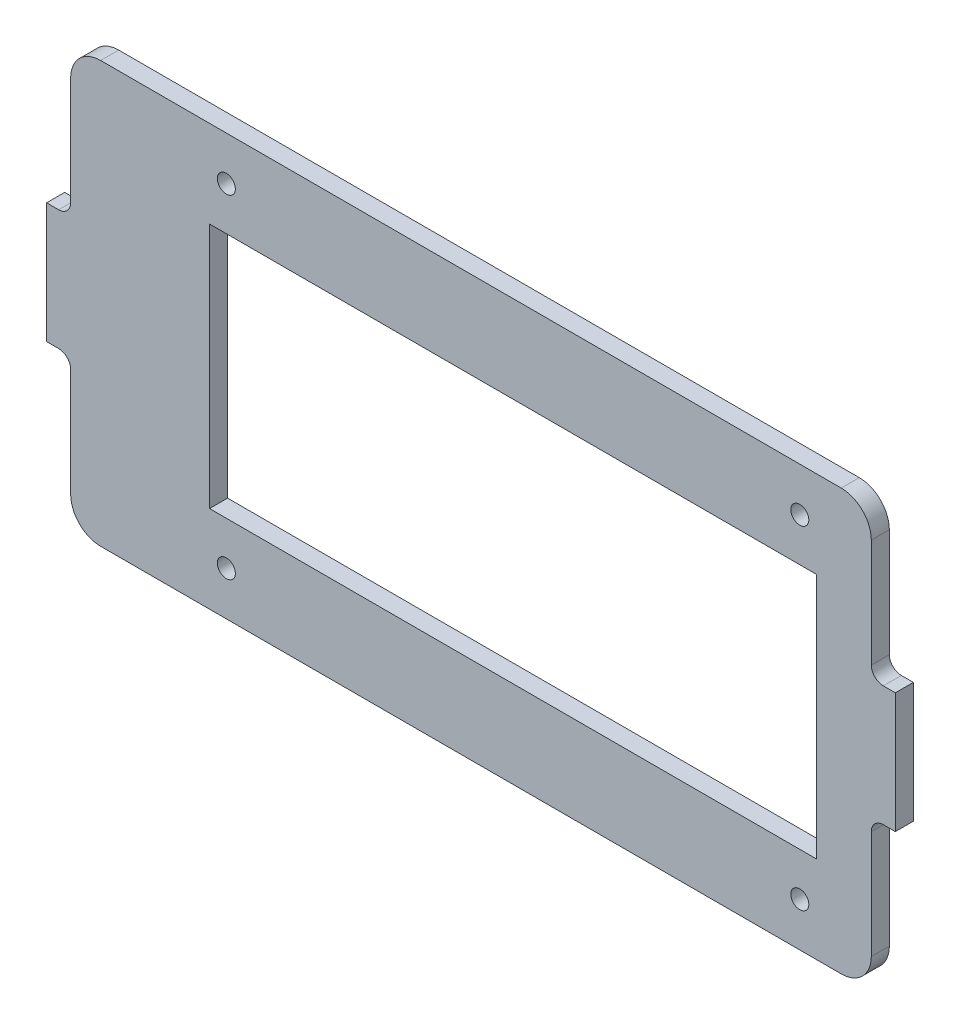
ISO-10303-21;
HEADER;
FILE_DESCRIPTION(('STEP AP214'),'2;1');
FILE_NAME('part.step','',(''),(''),'','','');
FILE_SCHEMA(('AUTOMOTIVE_DESIGN { 1 0 10303 214 1 1 1 1 }'));
ENDSEC;
DATA;
#1=APPLICATION_CONTEXT('core data for automotive mechanical design processes');
#2=APPLICATION_PROTOCOL_DEFINITION('international standard','automotive_design',2000,#1);
#3=PRODUCT_CONTEXT('',#1,'mechanical');
#4=PRODUCT('Part','Part','',(#3));
#5=PRODUCT_RELATED_PRODUCT_CATEGORY('part','',(#4));
#6=PRODUCT_DEFINITION_FORMATION('','',#4);
#7=PRODUCT_DEFINITION_CONTEXT('part definition',#1,'design');
#8=PRODUCT_DEFINITION('design','',#6,#7);
#9=PRODUCT_DEFINITION_SHAPE('','',#8);
#10=(LENGTH_UNIT() NAMED_UNIT(*) SI_UNIT(.MILLI.,.METRE.));
#11=(NAMED_UNIT(*) PLANE_ANGLE_UNIT() SI_UNIT($,.RADIAN.));
#12=(NAMED_UNIT(*) SI_UNIT($,.STERADIAN.) SOLID_ANGLE_UNIT());
#13=UNCERTAINTY_MEASURE_WITH_UNIT(LENGTH_MEASURE(1.E-05),#10,'distance_accuracy_value','');
#14=(GEOMETRIC_REPRESENTATION_CONTEXT(3) GLOBAL_UNCERTAINTY_ASSIGNED_CONTEXT((#13)) GLOBAL_UNIT_ASSIGNED_CONTEXT((#10,
#11,#12)) REPRESENTATION_CONTEXT('',''));
#15=CARTESIAN_POINT('',(0.,0.,0.));
#16=DIRECTION('',(0.,0.,1.));
#17=DIRECTION('',(1.,0.,0.));
#18=AXIS2_PLACEMENT_3D('',#15,#16,#17);
#19=CARTESIAN_POINT('',(-61.6,30.,3.));
#20=DIRECTION('',(0.,0.,1.));
#21=DIRECTION('',(1.,0.,0.));
#22=AXIS2_PLACEMENT_3D('',#19,#20,#21);
#23=PLANE('',#22);
#24=CARTESIAN_POINT('',(-40.7,27.7,3.));
#25=DIRECTION('',(0.,0.,1.));
#26=DIRECTION('',(1.,0.,0.));
#27=AXIS2_PLACEMENT_3D('',#24,#25,#26);
#28=CIRCLE('',#27,1.5);
#29=CARTESIAN_POINT('',(-39.2,27.7,3.));
#30=VERTEX_POINT('',#29);
#31=EDGE_CURVE('E726',#30,#30,#28,.T.);
#32=ORIENTED_EDGE('',*,*,#31,.F.);
#33=EDGE_LOOP('',(#32));
#34=FACE_BOUND('',#33,.T.);
#35=CARTESIAN_POINT('',(-40.6999999999997,-27.7,3.));
#36=DIRECTION('',(0.,0.,1.));
#37=DIRECTION('',(1.,0.,0.));
#38=AXIS2_PLACEMENT_3D('',#35,#36,#37);
#39=CIRCLE('',#38,1.5);
#40=CARTESIAN_POINT('',(-39.1999999999997,-27.7,3.));
#41=VERTEX_POINT('',#40);
#42=EDGE_CURVE('E728',#41,#41,#39,.T.);
#43=ORIENTED_EDGE('',*,*,#42,.F.);
#44=EDGE_LOOP('',(#43));
#45=FACE_BOUND('',#44,.T.);
#46=CARTESIAN_POINT('',(54.7,-27.7,3.));
#47=DIRECTION('',(0.,0.,1.));
#48=DIRECTION('',(1.,0.,0.));
#49=AXIS2_PLACEMENT_3D('',#46,#47,#48);
#50=CIRCLE('',#49,1.5);
#51=CARTESIAN_POINT('',(56.2,-27.7,3.));
#52=VERTEX_POINT('',#51);
#53=EDGE_CURVE('E736',#52,#52,#50,.T.);
#54=ORIENTED_EDGE('',*,*,#53,.F.);
#55=EDGE_LOOP('',(#54));
#56=FACE_BOUND('',#55,.T.);
#57=CARTESIAN_POINT('',(54.6999999999997,27.7,3.));
#58=DIRECTION('',(0.,0.,1.));
#59=DIRECTION('',(1.,0.,0.));
#60=AXIS2_PLACEMENT_3D('',#57,#58,#59);
#61=CIRCLE('',#60,1.5);
#62=CARTESIAN_POINT('',(56.1999999999997,27.7,3.));
#63=VERTEX_POINT('',#62);
#64=EDGE_CURVE('E742',#63,#63,#61,.T.);
#65=ORIENTED_EDGE('',*,*,#64,.F.);
#66=EDGE_LOOP('',(#65));
#67=FACE_BOUND('',#66,.T.);
#68=CARTESIAN_POINT('',(-61.6,30.,3.));
#69=DIRECTION('',(0.,0.,1.));
#70=DIRECTION('',(1.,0.,0.));
#71=AXIS2_PLACEMENT_3D('',#68,#69,#70);
#72=CIRCLE('',#71,5.);
#73=CARTESIAN_POINT('',(-61.6,35.,3.));
#74=VERTEX_POINT('',#73);
#75=CARTESIAN_POINT('',(-66.6,30.,3.));
#76=VERTEX_POINT('',#75);
#77=EDGE_CURVE('E232',#74,#76,#72,.T.);
#78=ORIENTED_EDGE('',*,*,#77,.T.);
#79=DIRECTION('',(0.,-1.,0.));
#80=VECTOR('',#79,1.);
#81=CARTESIAN_POINT('',(-66.6,30.,3.));
#82=LINE('',#81,#80);
#83=CARTESIAN_POINT('',(-66.6,12.,3.));
#84=VERTEX_POINT('',#83);
#85=EDGE_CURVE('E235',#76,#84,#82,.T.);
#86=ORIENTED_EDGE('',*,*,#85,.T.);
#87=CARTESIAN_POINT('',(-68.6,12.,3.));
#88=DIRECTION('',(0.,0.,-1.));
#89=DIRECTION('',(1.,0.,0.));
#90=AXIS2_PLACEMENT_3D('',#87,#88,#89);
#91=CIRCLE('',#90,1.99999999999999);
#92=CARTESIAN_POINT('',(-68.6,9.99999999999998,3.));
#93=VERTEX_POINT('',#92);
#94=EDGE_CURVE('E238',#84,#93,#91,.T.);
#95=ORIENTED_EDGE('',*,*,#94,.T.);
#96=DIRECTION('',(-1.,0.,0.));
#97=VECTOR('',#96,1.);
#98=CARTESIAN_POINT('',(-68.6,9.99999999999998,3.));
#99=LINE('',#98,#97);
#100=CARTESIAN_POINT('',(-70.6,9.99999999999998,3.));
#101=VERTEX_POINT('',#100);
#102=EDGE_CURVE('E240',#93,#101,#99,.T.);
#103=ORIENTED_EDGE('',*,*,#102,.T.);
#104=DIRECTION('',(0.,-1.,0.));
#105=VECTOR('',#104,1.);
#106=CARTESIAN_POINT('',(-70.6,9.99999999999998,3.));
#107=LINE('',#106,#105);
#108=CARTESIAN_POINT('',(-70.6,-10.,3.));
#109=VERTEX_POINT('',#108);
#110=EDGE_CURVE('E242',#101,#109,#107,.T.);
#111=ORIENTED_EDGE('',*,*,#110,.T.);
#112=DIRECTION('',(1.,0.,0.));
#113=VECTOR('',#112,1.);
#114=CARTESIAN_POINT('',(-68.6,-10.,3.));
#115=LINE('',#114,#113);
#116=CARTESIAN_POINT('',(-68.6,-10.,3.));
#117=VERTEX_POINT('',#116);
#118=EDGE_CURVE('E244',#109,#117,#115,.T.);
#119=ORIENTED_EDGE('',*,*,#118,.T.);
#120=CARTESIAN_POINT('',(-68.6,-12.,3.));
#121=DIRECTION('',(0.,0.,-1.));
#122=DIRECTION('',(-1.,0.,0.));
#123=AXIS2_PLACEMENT_3D('',#120,#121,#122);
#124=CIRCLE('',#123,1.99999999999999);
#125=CARTESIAN_POINT('',(-66.6,-12.,3.));
#126=VERTEX_POINT('',#125);
#127=EDGE_CURVE('E246',#117,#126,#124,.T.);
#128=ORIENTED_EDGE('',*,*,#127,.T.);
#129=DIRECTION('',(0.,-1.,0.));
#130=VECTOR('',#129,1.);
#131=CARTESIAN_POINT('',(-66.6,-30.,3.));
#132=LINE('',#131,#130);
#133=CARTESIAN_POINT('',(-66.6,-30.,3.));
#134=VERTEX_POINT('',#133);
#135=EDGE_CURVE('E248',#126,#134,#132,.T.);
#136=ORIENTED_EDGE('',*,*,#135,.T.);
#137=CARTESIAN_POINT('',(-61.6,-30.,3.));
#138=DIRECTION('',(0.,0.,1.));
#139=DIRECTION('',(1.,0.,0.));
#140=AXIS2_PLACEMENT_3D('',#137,#138,#139);
#141=CIRCLE('',#140,4.99999999999999);
#142=CARTESIAN_POINT('',(-61.6,-35.,3.));
#143=VERTEX_POINT('',#142);
#144=EDGE_CURVE('E250',#134,#143,#141,.T.);
#145=ORIENTED_EDGE('',*,*,#144,.T.);
#146=DIRECTION('',(1.,0.,0.));
#147=VECTOR('',#146,1.);
#148=CARTESIAN_POINT('',(-61.6,-35.,3.));
#149=LINE('',#148,#147);
#150=CARTESIAN_POINT('',(61.6,-35.,3.));
#151=VERTEX_POINT('',#150);
#152=EDGE_CURVE('E252',#143,#151,#149,.T.);
#153=ORIENTED_EDGE('',*,*,#152,.T.);
#154=CARTESIAN_POINT('',(61.6,-30.,3.));
#155=DIRECTION('',(0.,0.,1.));
#156=DIRECTION('',(1.,0.,0.));
#157=AXIS2_PLACEMENT_3D('',#154,#155,#156);
#158=CIRCLE('',#157,5.);
#159=CARTESIAN_POINT('',(66.6,-30.,3.));
#160=VERTEX_POINT('',#159);
#161=EDGE_CURVE('E254',#151,#160,#158,.T.);
#162=ORIENTED_EDGE('',*,*,#161,.T.);
#163=DIRECTION('',(0.,1.,0.));
#164=VECTOR('',#163,1.);
#165=CARTESIAN_POINT('',(66.6,-30.,3.));
#166=LINE('',#165,#164);
#167=CARTESIAN_POINT('',(66.6,-12.,3.));
#168=VERTEX_POINT('',#167);
#169=EDGE_CURVE('E256',#160,#168,#166,.T.);
#170=ORIENTED_EDGE('',*,*,#169,.T.);
#171=CARTESIAN_POINT('',(68.6,-12.,3.));
#172=DIRECTION('',(0.,0.,-1.));
#173=DIRECTION('',(1.,0.,0.));
#174=AXIS2_PLACEMENT_3D('',#171,#172,#173);
#175=CIRCLE('',#174,1.99999999999999);
#176=CARTESIAN_POINT('',(68.6,-10.,3.));
#177=VERTEX_POINT('',#176);
#178=EDGE_CURVE('E258',#168,#177,#175,.T.);
#179=ORIENTED_EDGE('',*,*,#178,.T.);
#180=DIRECTION('',(1.,0.,0.));
#181=VECTOR('',#180,1.);
#182=CARTESIAN_POINT('',(68.6,-10.,3.));
#183=LINE('',#182,#181);
#184=CARTESIAN_POINT('',(70.6,-10.,3.));
#185=VERTEX_POINT('',#184);
#186=EDGE_CURVE('E260',#177,#185,#183,.T.);
#187=ORIENTED_EDGE('',*,*,#186,.T.);
#188=DIRECTION('',(0.,1.,0.));
#189=VECTOR('',#188,1.);
#190=CARTESIAN_POINT('',(70.6,10.,3.));
#191=LINE('',#190,#189);
#192=CARTESIAN_POINT('',(70.6,10.,3.));
#193=VERTEX_POINT('',#192);
#194=EDGE_CURVE('E262',#185,#193,#191,.T.);
#195=ORIENTED_EDGE('',*,*,#194,.T.);
#196=DIRECTION('',(-1.,0.,0.));
#197=VECTOR('',#196,1.);
#198=CARTESIAN_POINT('',(68.6,10.,3.));
#199=LINE('',#198,#197);
#200=CARTESIAN_POINT('',(68.6,10.,3.));
#201=VERTEX_POINT('',#200);
#202=EDGE_CURVE('E264',#193,#201,#199,.T.);
#203=ORIENTED_EDGE('',*,*,#202,.T.);
#204=CARTESIAN_POINT('',(68.6,12.,3.));
#205=DIRECTION('',(0.,0.,-1.));
#206=DIRECTION('',(-1.,0.,0.));
#207=AXIS2_PLACEMENT_3D('',#204,#205,#206);
#208=CIRCLE('',#207,1.99999999999999);
#209=CARTESIAN_POINT('',(66.6,12.,3.));
#210=VERTEX_POINT('',#209);
#211=EDGE_CURVE('E266',#201,#210,#208,.T.);
#212=ORIENTED_EDGE('',*,*,#211,.T.);
#213=DIRECTION('',(0.,1.,0.));
#214=VECTOR('',#213,1.);
#215=CARTESIAN_POINT('',(66.6,30.,3.));
#216=LINE('',#215,#214);
#217=CARTESIAN_POINT('',(66.6,30.,3.));
#218=VERTEX_POINT('',#217);
#219=EDGE_CURVE('E268',#210,#218,#216,.T.);
#220=ORIENTED_EDGE('',*,*,#219,.T.);
#221=CARTESIAN_POINT('',(61.6,30.,3.));
#222=DIRECTION('',(0.,0.,1.));
#223=DIRECTION('',(-1.,0.,0.));
#224=AXIS2_PLACEMENT_3D('',#221,#222,#223);
#225=CIRCLE('',#224,5.);
#226=CARTESIAN_POINT('',(61.6,35.,3.));
#227=VERTEX_POINT('',#226);
#228=EDGE_CURVE('E270',#218,#227,#225,.T.);
#229=ORIENTED_EDGE('',*,*,#228,.T.);
#230=DIRECTION('',(-1.,0.,0.));
#231=VECTOR('',#230,1.);
#232=CARTESIAN_POINT('',(-61.6,35.,3.));
#233=LINE('',#232,#231);
#234=EDGE_CURVE('E272',#227,#74,#233,.T.);
#235=ORIENTED_EDGE('',*,*,#234,.T.);
#236=EDGE_LOOP('',(#78,#86,#95,#103,#111,#119,#128,#136,#145,#153,#162,#170,#179,#187,#195,#203,
#212,#220,#229,#235));
#237=FACE_BOUND('',#236,.T.);
#238=DIRECTION('',(1.,0.,0.));
#239=VECTOR('',#238,1.);
#240=CARTESIAN_POINT('',(-43.5,-20.5,3.));
#241=LINE('',#240,#239);
#242=CARTESIAN_POINT('',(-43.5,-20.5,3.));
#243=VERTEX_POINT('',#242);
#244=CARTESIAN_POINT('',(57.5,-20.5,3.));
#245=VERTEX_POINT('',#244);
#246=EDGE_CURVE('E202',#243,#245,#241,.T.);
#247=ORIENTED_EDGE('',*,*,#246,.F.);
#248=DIRECTION('',(0.,-1.,0.));
#249=VECTOR('',#248,1.);
#250=CARTESIAN_POINT('',(-43.5,20.5,3.));
#251=LINE('',#250,#249);
#252=CARTESIAN_POINT('',(-43.5,20.5,3.));
#253=VERTEX_POINT('',#252);
#254=EDGE_CURVE('E194',#253,#243,#251,.T.);
#255=ORIENTED_EDGE('',*,*,#254,.F.);
#256=DIRECTION('',(-1.,0.,0.));
#257=VECTOR('',#256,1.);
#258=CARTESIAN_POINT('',(-43.5,20.5,3.));
#259=LINE('',#258,#257);
#260=CARTESIAN_POINT('',(57.5,20.5,3.));
#261=VERTEX_POINT('',#260);
#262=EDGE_CURVE('E216',#261,#253,#259,.T.);
#263=ORIENTED_EDGE('',*,*,#262,.F.);
#264=DIRECTION('',(0.,1.,0.));
#265=VECTOR('',#264,1.);
#266=CARTESIAN_POINT('',(57.5,20.5,3.));
#267=LINE('',#266,#265);
#268=EDGE_CURVE('E214',#245,#261,#267,.T.);
#269=ORIENTED_EDGE('',*,*,#268,.F.);
#270=EDGE_LOOP('',(#247,#255,#263,#269));
#271=FACE_BOUND('',#270,.T.);
#272=ADVANCED_FACE('F33',(#34,#45,#56,#67,#237,#271),#23,.T.);
#273=CARTESIAN_POINT('',(-61.6,30.,0.));
#274=DIRECTION('',(0.,0.,1.));
#275=DIRECTION('',(1.,0.,0.));
#276=AXIS2_PLACEMENT_3D('',#273,#274,#275);
#277=PLANE('',#276);
#278=CARTESIAN_POINT('',(-40.7,27.7,0.));
#279=DIRECTION('',(0.,0.,1.));
#280=DIRECTION('',(1.,0.,0.));
#281=AXIS2_PLACEMENT_3D('',#278,#279,#280);
#282=CIRCLE('',#281,1.5);
#283=CARTESIAN_POINT('',(-39.2,27.7,0.));
#284=VERTEX_POINT('',#283);
#285=EDGE_CURVE('E724',#284,#284,#282,.T.);
#286=ORIENTED_EDGE('',*,*,#285,.T.);
#287=EDGE_LOOP('',(#286));
#288=FACE_BOUND('',#287,.T.);
#289=CARTESIAN_POINT('',(-40.6999999999997,-27.7,0.));
#290=DIRECTION('',(0.,0.,1.));
#291=DIRECTION('',(1.,0.,0.));
#292=AXIS2_PLACEMENT_3D('',#289,#290,#291);
#293=CIRCLE('',#292,1.5);
#294=CARTESIAN_POINT('',(-39.1999999999997,-27.7,0.));
#295=VERTEX_POINT('',#294);
#296=EDGE_CURVE('E733',#295,#295,#293,.T.);
#297=ORIENTED_EDGE('',*,*,#296,.T.);
#298=EDGE_LOOP('',(#297));
#299=FACE_BOUND('',#298,.T.);
#300=CARTESIAN_POINT('',(54.7,-27.7,0.));
#301=DIRECTION('',(0.,0.,1.));
#302=DIRECTION('',(1.,0.,0.));
#303=AXIS2_PLACEMENT_3D('',#300,#301,#302);
#304=CIRCLE('',#303,1.5);
#305=CARTESIAN_POINT('',(56.2,-27.7,0.));
#306=VERTEX_POINT('',#305);
#307=EDGE_CURVE('E739',#306,#306,#304,.T.);
#308=ORIENTED_EDGE('',*,*,#307,.T.);
#309=EDGE_LOOP('',(#308));
#310=FACE_BOUND('',#309,.T.);
#311=CARTESIAN_POINT('',(54.6999999999997,27.7,0.));
#312=DIRECTION('',(0.,0.,1.));
#313=DIRECTION('',(1.,0.,0.));
#314=AXIS2_PLACEMENT_3D('',#311,#312,#313);
#315=CIRCLE('',#314,1.5);
#316=CARTESIAN_POINT('',(56.1999999999997,27.7,0.));
#317=VERTEX_POINT('',#316);
#318=EDGE_CURVE('E222',#317,#317,#315,.T.);
#319=ORIENTED_EDGE('',*,*,#318,.T.);
#320=EDGE_LOOP('',(#319));
#321=FACE_BOUND('',#320,.T.);
#322=CARTESIAN_POINT('',(-61.6,30.,0.));
#323=DIRECTION('',(0.,0.,1.));
#324=DIRECTION('',(1.,0.,0.));
#325=AXIS2_PLACEMENT_3D('',#322,#323,#324);
#326=CIRCLE('',#325,5.);
#327=CARTESIAN_POINT('',(-61.6,35.,0.));
#328=VERTEX_POINT('',#327);
#329=CARTESIAN_POINT('',(-66.6,30.,0.));
#330=VERTEX_POINT('',#329);
#331=EDGE_CURVE('E210',#328,#330,#326,.T.);
#332=ORIENTED_EDGE('',*,*,#331,.F.);
#333=DIRECTION('',(-1.,0.,0.));
#334=VECTOR('',#333,1.);
#335=CARTESIAN_POINT('',(-61.6,35.,0.));
#336=LINE('',#335,#334);
#337=CARTESIAN_POINT('',(61.6,35.,0.));
#338=VERTEX_POINT('',#337);
#339=EDGE_CURVE('E236',#338,#328,#336,.T.);
#340=ORIENTED_EDGE('',*,*,#339,.F.);
#341=CARTESIAN_POINT('',(61.6,30.,0.));
#342=DIRECTION('',(0.,0.,1.));
#343=DIRECTION('',(-1.,0.,0.));
#344=AXIS2_PLACEMENT_3D('',#341,#342,#343);
#345=CIRCLE('',#344,5.);
#346=CARTESIAN_POINT('',(66.6,30.,0.));
#347=VERTEX_POINT('',#346);
#348=EDGE_CURVE('E311',#347,#338,#345,.T.);
#349=ORIENTED_EDGE('',*,*,#348,.F.);
#350=DIRECTION('',(0.,1.,0.));
#351=VECTOR('',#350,1.);
#352=CARTESIAN_POINT('',(66.6,30.,0.));
#353=LINE('',#352,#351);
#354=CARTESIAN_POINT('',(66.6,12.,0.));
#355=VERTEX_POINT('',#354);
#356=EDGE_CURVE('E309',#355,#347,#353,.T.);
#357=ORIENTED_EDGE('',*,*,#356,.F.);
#358=CARTESIAN_POINT('',(68.6,12.,0.));
#359=DIRECTION('',(0.,0.,-1.));
#360=DIRECTION('',(-1.,0.,0.));
#361=AXIS2_PLACEMENT_3D('',#358,#359,#360);
#362=CIRCLE('',#361,1.99999999999999);
#363=CARTESIAN_POINT('',(68.6,10.,0.));
#364=VERTEX_POINT('',#363);
#365=EDGE_CURVE('E307',#364,#355,#362,.T.);
#366=ORIENTED_EDGE('',*,*,#365,.F.);
#367=DIRECTION('',(-1.,0.,0.));
#368=VECTOR('',#367,1.);
#369=CARTESIAN_POINT('',(68.6,10.,0.));
#370=LINE('',#369,#368);
#371=CARTESIAN_POINT('',(70.6,10.,0.));
#372=VERTEX_POINT('',#371);
#373=EDGE_CURVE('E305',#372,#364,#370,.T.);
#374=ORIENTED_EDGE('',*,*,#373,.F.);
#375=DIRECTION('',(0.,1.,0.));
#376=VECTOR('',#375,1.);
#377=CARTESIAN_POINT('',(70.6,10.,0.));
#378=LINE('',#377,#376);
#379=CARTESIAN_POINT('',(70.6,-10.,0.));
#380=VERTEX_POINT('',#379);
#381=EDGE_CURVE('E303',#380,#372,#378,.T.);
#382=ORIENTED_EDGE('',*,*,#381,.F.);
#383=DIRECTION('',(1.,0.,0.));
#384=VECTOR('',#383,1.);
#385=CARTESIAN_POINT('',(68.6,-10.,0.));
#386=LINE('',#385,#384);
#387=CARTESIAN_POINT('',(68.6,-10.,0.));
#388=VERTEX_POINT('',#387);
#389=EDGE_CURVE('E301',#388,#380,#386,.T.);
#390=ORIENTED_EDGE('',*,*,#389,.F.);
#391=CARTESIAN_POINT('',(68.6,-12.,0.));
#392=DIRECTION('',(0.,0.,-1.));
#393=DIRECTION('',(1.,0.,0.));
#394=AXIS2_PLACEMENT_3D('',#391,#392,#393);
#395=CIRCLE('',#394,1.99999999999999);
#396=CARTESIAN_POINT('',(66.6,-12.,0.));
#397=VERTEX_POINT('',#396);
#398=EDGE_CURVE('E299',#397,#388,#395,.T.);
#399=ORIENTED_EDGE('',*,*,#398,.F.);
#400=DIRECTION('',(0.,1.,0.));
#401=VECTOR('',#400,1.);
#402=CARTESIAN_POINT('',(66.6,-30.,0.));
#403=LINE('',#402,#401);
#404=CARTESIAN_POINT('',(66.6,-30.,0.));
#405=VERTEX_POINT('',#404);
#406=EDGE_CURVE('E297',#405,#397,#403,.T.);
#407=ORIENTED_EDGE('',*,*,#406,.F.);
#408=CARTESIAN_POINT('',(61.6,-30.,0.));
#409=DIRECTION('',(0.,0.,1.));
#410=DIRECTION('',(1.,0.,0.));
#411=AXIS2_PLACEMENT_3D('',#408,#409,#410);
#412=CIRCLE('',#411,5.);
#413=CARTESIAN_POINT('',(61.6,-35.,0.));
#414=VERTEX_POINT('',#413);
#415=EDGE_CURVE('E295',#414,#405,#412,.T.);
#416=ORIENTED_EDGE('',*,*,#415,.F.);
#417=DIRECTION('',(1.,0.,0.));
#418=VECTOR('',#417,1.);
#419=CARTESIAN_POINT('',(-61.6,-35.,0.));
#420=LINE('',#419,#418);
#421=CARTESIAN_POINT('',(-61.6,-35.,0.));
#422=VERTEX_POINT('',#421);
#423=EDGE_CURVE('E293',#422,#414,#420,.T.);
#424=ORIENTED_EDGE('',*,*,#423,.F.);
#425=CARTESIAN_POINT('',(-61.6,-30.,0.));
#426=DIRECTION('',(0.,0.,1.));
#427=DIRECTION('',(1.,0.,0.));
#428=AXIS2_PLACEMENT_3D('',#425,#426,#427);
#429=CIRCLE('',#428,4.99999999999999);
#430=CARTESIAN_POINT('',(-66.6,-30.,0.));
#431=VERTEX_POINT('',#430);
#432=EDGE_CURVE('E291',#431,#422,#429,.T.);
#433=ORIENTED_EDGE('',*,*,#432,.F.);
#434=DIRECTION('',(0.,-1.,0.));
#435=VECTOR('',#434,1.);
#436=CARTESIAN_POINT('',(-66.6,-30.,0.));
#437=LINE('',#436,#435);
#438=CARTESIAN_POINT('',(-66.6,-12.,0.));
#439=VERTEX_POINT('',#438);
#440=EDGE_CURVE('E289',#439,#431,#437,.T.);
#441=ORIENTED_EDGE('',*,*,#440,.F.);
#442=CARTESIAN_POINT('',(-68.6,-12.,0.));
#443=DIRECTION('',(0.,0.,-1.));
#444=DIRECTION('',(-1.,0.,0.));
#445=AXIS2_PLACEMENT_3D('',#442,#443,#444);
#446=CIRCLE('',#445,1.99999999999999);
#447=CARTESIAN_POINT('',(-68.6,-10.,0.));
#448=VERTEX_POINT('',#447);
#449=EDGE_CURVE('E287',#448,#439,#446,.T.);
#450=ORIENTED_EDGE('',*,*,#449,.F.);
#451=DIRECTION('',(1.,0.,0.));
#452=VECTOR('',#451,1.);
#453=CARTESIAN_POINT('',(-68.6,-10.,0.));
#454=LINE('',#453,#452);
#455=CARTESIAN_POINT('',(-70.6,-10.,0.));
#456=VERTEX_POINT('',#455);
#457=EDGE_CURVE('E285',#456,#448,#454,.T.);
#458=ORIENTED_EDGE('',*,*,#457,.F.);
#459=DIRECTION('',(0.,-1.,0.));
#460=VECTOR('',#459,1.);
#461=CARTESIAN_POINT('',(-70.6,9.99999999999998,0.));
#462=LINE('',#461,#460);
#463=CARTESIAN_POINT('',(-70.6,9.99999999999998,0.));
#464=VERTEX_POINT('',#463);
#465=EDGE_CURVE('E283',#464,#456,#462,.T.);
#466=ORIENTED_EDGE('',*,*,#465,.F.);
#467=DIRECTION('',(-1.,0.,0.));
#468=VECTOR('',#467,1.);
#469=CARTESIAN_POINT('',(-68.6,9.99999999999998,0.));
#470=LINE('',#469,#468);
#471=CARTESIAN_POINT('',(-68.6,9.99999999999998,0.));
#472=VERTEX_POINT('',#471);
#473=EDGE_CURVE('E281',#472,#464,#470,.T.);
#474=ORIENTED_EDGE('',*,*,#473,.F.);
#475=CARTESIAN_POINT('',(-68.6,12.,0.));
#476=DIRECTION('',(0.,0.,-1.));
#477=DIRECTION('',(1.,0.,0.));
#478=AXIS2_PLACEMENT_3D('',#475,#476,#477);
#479=CIRCLE('',#478,1.99999999999999);
#480=CARTESIAN_POINT('',(-66.6,12.,0.));
#481=VERTEX_POINT('',#480);
#482=EDGE_CURVE('E279',#481,#472,#479,.T.);
#483=ORIENTED_EDGE('',*,*,#482,.F.);
#484=DIRECTION('',(0.,-1.,0.));
#485=VECTOR('',#484,1.);
#486=CARTESIAN_POINT('',(-66.6,30.,0.));
#487=LINE('',#486,#485);
#488=EDGE_CURVE('E277',#330,#481,#487,.T.);
#489=ORIENTED_EDGE('',*,*,#488,.F.);
#490=EDGE_LOOP('',(#332,#340,#349,#357,#366,#374,#382,#390,#399,#407,#416,#424,#433,#441,#450,
#458,#466,#474,#483,#489));
#491=FACE_BOUND('',#490,.T.);
#492=DIRECTION('',(0.,-1.,0.));
#493=VECTOR('',#492,1.);
#494=CARTESIAN_POINT('',(-43.5,20.5,0.));
#495=LINE('',#494,#493);
#496=CARTESIAN_POINT('',(-43.5,20.5,0.));
#497=VERTEX_POINT('',#496);
#498=CARTESIAN_POINT('',(-43.5,-20.5,0.));
#499=VERTEX_POINT('',#498);
#500=EDGE_CURVE('E56',#497,#499,#495,.T.);
#501=ORIENTED_EDGE('',*,*,#500,.T.);
#502=DIRECTION('',(1.,0.,0.));
#503=VECTOR('',#502,1.);
#504=CARTESIAN_POINT('',(-43.5,-20.5,0.));
#505=LINE('',#504,#503);
#506=CARTESIAN_POINT('',(57.5,-20.5,0.));
#507=VERTEX_POINT('',#506);
#508=EDGE_CURVE('E209',#499,#507,#505,.T.);
#509=ORIENTED_EDGE('',*,*,#508,.T.);
#510=DIRECTION('',(0.,1.,0.));
#511=VECTOR('',#510,1.);
#512=CARTESIAN_POINT('',(57.5,20.5,0.));
#513=LINE('',#512,#511);
#514=CARTESIAN_POINT('',(57.5,20.5,0.));
#515=VERTEX_POINT('',#514);
#516=EDGE_CURVE('E224',#507,#515,#513,.T.);
#517=ORIENTED_EDGE('',*,*,#516,.T.);
#518=DIRECTION('',(-1.,0.,0.));
#519=VECTOR('',#518,1.);
#520=CARTESIAN_POINT('',(-43.5,20.5,0.));
#521=LINE('',#520,#519);
#522=EDGE_CURVE('E203',#515,#497,#521,.T.);
#523=ORIENTED_EDGE('',*,*,#522,.T.);
#524=EDGE_LOOP('',(#501,#509,#517,#523));
#525=FACE_BOUND('',#524,.T.);
#526=ADVANCED_FACE('F377',(#288,#299,#310,#321,#491,#525),#277,.F.);
#527=CARTESIAN_POINT('',(-61.6,30.,3.));
#528=DIRECTION('',(0.,0.,-1.));
#529=DIRECTION('',(-1.,0.,0.));
#530=AXIS2_PLACEMENT_3D('',#527,#528,#529);
#531=CYLINDRICAL_SURFACE('',#530,5.);
#532=ORIENTED_EDGE('',*,*,#331,.T.);
#533=DIRECTION('',(0.,0.,-1.));
#534=VECTOR('',#533,1.);
#535=CARTESIAN_POINT('',(-66.6,30.,3.));
#536=LINE('',#535,#534);
#537=EDGE_CURVE('E11',#76,#330,#536,.T.);
#538=ORIENTED_EDGE('',*,*,#537,.F.);
#539=ORIENTED_EDGE('',*,*,#77,.F.);
#540=DIRECTION('',(0.,0.,-1.));
#541=VECTOR('',#540,1.);
#542=CARTESIAN_POINT('',(-61.6,35.,3.));
#543=LINE('',#542,#541);
#544=EDGE_CURVE('E274',#74,#328,#543,.T.);
#545=ORIENTED_EDGE('',*,*,#544,.T.);
#546=EDGE_LOOP('',(#532,#538,#539,#545));
#547=FACE_BOUND('',#546,.T.);
#548=ADVANCED_FACE('F35',(#547),#531,.T.);
#549=CARTESIAN_POINT('',(-66.6,30.,3.));
#550=DIRECTION('',(1.,0.,0.));
#551=DIRECTION('',(0.,1.,0.));
#552=AXIS2_PLACEMENT_3D('',#549,#550,#551);
#553=PLANE('',#552);
#554=ORIENTED_EDGE('',*,*,#488,.T.);
#555=DIRECTION('',(0.,0.,-1.));
#556=VECTOR('',#555,1.);
#557=CARTESIAN_POINT('',(-66.6,12.,3.));
#558=LINE('',#557,#556);
#559=EDGE_CURVE('E41',#84,#481,#558,.T.);
#560=ORIENTED_EDGE('',*,*,#559,.F.);
#561=ORIENTED_EDGE('',*,*,#85,.F.);
#562=ORIENTED_EDGE('',*,*,#537,.T.);
#563=EDGE_LOOP('',(#554,#560,#561,#562));
#564=FACE_BOUND('',#563,.T.);
#565=ADVANCED_FACE('F394',(#564),#553,.F.);
#566=CARTESIAN_POINT('',(-68.6,12.,3.));
#567=DIRECTION('',(0.,0.,-1.));
#568=DIRECTION('',(-1.,0.,0.));
#569=AXIS2_PLACEMENT_3D('',#566,#567,#568);
#570=CYLINDRICAL_SURFACE('',#569,1.99999999999999);
#571=ORIENTED_EDGE('',*,*,#482,.T.);
#572=DIRECTION('',(0.,0.,-1.));
#573=VECTOR('',#572,1.);
#574=CARTESIAN_POINT('',(-68.6,9.99999999999998,3.));
#575=LINE('',#574,#573);
#576=EDGE_CURVE('E364',#93,#472,#575,.T.);
#577=ORIENTED_EDGE('',*,*,#576,.F.);
#578=ORIENTED_EDGE('',*,*,#94,.F.);
#579=ORIENTED_EDGE('',*,*,#559,.T.);
#580=EDGE_LOOP('',(#571,#577,#578,#579));
#581=FACE_BOUND('',#580,.T.);
#582=ADVANCED_FACE('F371',(#581),#570,.F.);
#583=CARTESIAN_POINT('',(-68.6,9.99999999999998,3.));
#584=DIRECTION('',(0.,-1.,0.));
#585=DIRECTION('',(0.,0.,-1.));
#586=AXIS2_PLACEMENT_3D('',#583,#584,#585);
#587=PLANE('',#586);
#588=ORIENTED_EDGE('',*,*,#473,.T.);
#589=DIRECTION('',(0.,0.,-1.));
#590=VECTOR('',#589,1.);
#591=CARTESIAN_POINT('',(-70.6,9.99999999999998,3.));
#592=LINE('',#591,#590);
#593=EDGE_CURVE('E361',#101,#464,#592,.T.);
#594=ORIENTED_EDGE('',*,*,#593,.F.);
#595=ORIENTED_EDGE('',*,*,#102,.F.);
#596=ORIENTED_EDGE('',*,*,#576,.T.);
#597=EDGE_LOOP('',(#588,#594,#595,#596));
#598=FACE_BOUND('',#597,.T.);
#599=ADVANCED_FACE('F383',(#598),#587,.F.);
#600=CARTESIAN_POINT('',(-70.6,9.99999999999998,3.));
#601=DIRECTION('',(1.,0.,0.));
#602=DIRECTION('',(0.,0.,-1.));
#603=AXIS2_PLACEMENT_3D('',#600,#601,#602);
#604=PLANE('',#603);
#605=ORIENTED_EDGE('',*,*,#465,.T.);
#606=DIRECTION('',(0.,0.,-1.));
#607=VECTOR('',#606,1.);
#608=CARTESIAN_POINT('',(-70.6,-10.,3.));
#609=LINE('',#608,#607);
#610=EDGE_CURVE('E358',#109,#456,#609,.T.);
#611=ORIENTED_EDGE('',*,*,#610,.F.);
#612=ORIENTED_EDGE('',*,*,#110,.F.);
#613=ORIENTED_EDGE('',*,*,#593,.T.);
#614=EDGE_LOOP('',(#605,#611,#612,#613));
#615=FACE_BOUND('',#614,.T.);
#616=ADVANCED_FACE('F387',(#615),#604,.F.);
#617=CARTESIAN_POINT('',(-68.6,-10.,3.));
#618=DIRECTION('',(0.,1.,0.));
#619=DIRECTION('',(0.,0.,1.));
#620=AXIS2_PLACEMENT_3D('',#617,#618,#619);
#621=PLANE('',#620);
#622=ORIENTED_EDGE('',*,*,#457,.T.);
#623=DIRECTION('',(0.,0.,-1.));
#624=VECTOR('',#623,1.);
#625=CARTESIAN_POINT('',(-68.6,-10.,3.));
#626=LINE('',#625,#624);
#627=EDGE_CURVE('E355',#117,#448,#626,.T.);
#628=ORIENTED_EDGE('',*,*,#627,.F.);
#629=ORIENTED_EDGE('',*,*,#118,.F.);
#630=ORIENTED_EDGE('',*,*,#610,.T.);
#631=EDGE_LOOP('',(#622,#628,#629,#630));
#632=FACE_BOUND('',#631,.T.);
#633=ADVANCED_FACE('F467',(#632),#621,.F.);
#634=CARTESIAN_POINT('',(-68.6,-12.,3.));
#635=DIRECTION('',(0.,0.,-1.));
#636=DIRECTION('',(-1.,0.,0.));
#637=AXIS2_PLACEMENT_3D('',#634,#635,#636);
#638=CYLINDRICAL_SURFACE('',#637,1.99999999999999);
#639=ORIENTED_EDGE('',*,*,#449,.T.);
#640=DIRECTION('',(0.,0.,-1.));
#641=VECTOR('',#640,1.);
#642=CARTESIAN_POINT('',(-66.6,-12.,3.));
#643=LINE('',#642,#641);
#644=EDGE_CURVE('E352',#126,#439,#643,.T.);
#645=ORIENTED_EDGE('',*,*,#644,.F.);
#646=ORIENTED_EDGE('',*,*,#127,.F.);
#647=ORIENTED_EDGE('',*,*,#627,.T.);
#648=EDGE_LOOP('',(#639,#645,#646,#647));
#649=FACE_BOUND('',#648,.T.);
#650=ADVANCED_FACE('F465',(#649),#638,.F.);
#651=CARTESIAN_POINT('',(-66.6,-30.,3.));
#652=DIRECTION('',(1.,0.,0.));
#653=DIRECTION('',(0.,1.,0.));
#654=AXIS2_PLACEMENT_3D('',#651,#652,#653);
#655=PLANE('',#654);
#656=ORIENTED_EDGE('',*,*,#440,.T.);
#657=DIRECTION('',(0.,0.,-1.));
#658=VECTOR('',#657,1.);
#659=CARTESIAN_POINT('',(-66.6,-30.,3.));
#660=LINE('',#659,#658);
#661=EDGE_CURVE('E349',#134,#431,#660,.T.);
#662=ORIENTED_EDGE('',*,*,#661,.F.);
#663=ORIENTED_EDGE('',*,*,#135,.F.);
#664=ORIENTED_EDGE('',*,*,#644,.T.);
#665=EDGE_LOOP('',(#656,#662,#663,#664));
#666=FACE_BOUND('',#665,.T.);
#667=ADVANCED_FACE('F460',(#666),#655,.F.);
#668=CARTESIAN_POINT('',(-61.6,-30.,3.));
#669=DIRECTION('',(0.,0.,-1.));
#670=DIRECTION('',(-1.,0.,0.));
#671=AXIS2_PLACEMENT_3D('',#668,#669,#670);
#672=CYLINDRICAL_SURFACE('',#671,4.99999999999999);
#673=ORIENTED_EDGE('',*,*,#432,.T.);
#674=DIRECTION('',(0.,0.,-1.));
#675=VECTOR('',#674,1.);
#676=CARTESIAN_POINT('',(-61.6,-35.,3.));
#677=LINE('',#676,#675);
#678=EDGE_CURVE('E346',#143,#422,#677,.T.);
#679=ORIENTED_EDGE('',*,*,#678,.F.);
#680=ORIENTED_EDGE('',*,*,#144,.F.);
#681=ORIENTED_EDGE('',*,*,#661,.T.);
#682=EDGE_LOOP('',(#673,#679,#680,#681));
#683=FACE_BOUND('',#682,.T.);
#684=ADVANCED_FACE('F455',(#683),#672,.T.);
#685=CARTESIAN_POINT('',(-61.6,-35.,3.));
#686=DIRECTION('',(0.,1.,0.));
#687=DIRECTION('',(-1.,0.,0.));
#688=AXIS2_PLACEMENT_3D('',#685,#686,#687);
#689=PLANE('',#688);
#690=ORIENTED_EDGE('',*,*,#423,.T.);
#691=DIRECTION('',(0.,0.,-1.));
#692=VECTOR('',#691,1.);
#693=CARTESIAN_POINT('',(61.6,-35.,3.));
#694=LINE('',#693,#692);
#695=EDGE_CURVE('E343',#151,#414,#694,.T.);
#696=ORIENTED_EDGE('',*,*,#695,.F.);
#697=ORIENTED_EDGE('',*,*,#152,.F.);
#698=ORIENTED_EDGE('',*,*,#678,.T.);
#699=EDGE_LOOP('',(#690,#696,#697,#698));
#700=FACE_BOUND('',#699,.T.);
#701=ADVANCED_FACE('F451',(#700),#689,.F.);
#702=CARTESIAN_POINT('',(61.6,-30.,3.));
#703=DIRECTION('',(0.,0.,-1.));
#704=DIRECTION('',(-1.,0.,0.));
#705=AXIS2_PLACEMENT_3D('',#702,#703,#704);
#706=CYLINDRICAL_SURFACE('',#705,5.);
#707=ORIENTED_EDGE('',*,*,#415,.T.);
#708=DIRECTION('',(0.,0.,-1.));
#709=VECTOR('',#708,1.);
#710=CARTESIAN_POINT('',(66.6,-30.,3.));
#711=LINE('',#710,#709);
#712=EDGE_CURVE('E340',#160,#405,#711,.T.);
#713=ORIENTED_EDGE('',*,*,#712,.F.);
#714=ORIENTED_EDGE('',*,*,#161,.F.);
#715=ORIENTED_EDGE('',*,*,#695,.T.);
#716=EDGE_LOOP('',(#707,#713,#714,#715));
#717=FACE_BOUND('',#716,.T.);
#718=ADVANCED_FACE('F446',(#717),#706,.T.);
#719=CARTESIAN_POINT('',(66.6,-30.,3.));
#720=DIRECTION('',(-1.,0.,0.));
#721=DIRECTION('',(0.,0.,1.));
#722=AXIS2_PLACEMENT_3D('',#719,#720,#721);
#723=PLANE('',#722);
#724=ORIENTED_EDGE('',*,*,#406,.T.);
#725=DIRECTION('',(0.,0.,-1.));
#726=VECTOR('',#725,1.);
#727=CARTESIAN_POINT('',(66.6,-12.,3.));
#728=LINE('',#727,#726);
#729=EDGE_CURVE('E337',#168,#397,#728,.T.);
#730=ORIENTED_EDGE('',*,*,#729,.F.);
#731=ORIENTED_EDGE('',*,*,#169,.F.);
#732=ORIENTED_EDGE('',*,*,#712,.T.);
#733=EDGE_LOOP('',(#724,#730,#731,#732));
#734=FACE_BOUND('',#733,.T.);
#735=ADVANCED_FACE('F440',(#734),#723,.F.);
#736=CARTESIAN_POINT('',(68.6,-12.,3.));
#737=DIRECTION('',(0.,0.,-1.));
#738=DIRECTION('',(-1.,0.,0.));
#739=AXIS2_PLACEMENT_3D('',#736,#737,#738);
#740=CYLINDRICAL_SURFACE('',#739,1.99999999999999);
#741=ORIENTED_EDGE('',*,*,#398,.T.);
#742=DIRECTION('',(0.,0.,-1.));
#743=VECTOR('',#742,1.);
#744=CARTESIAN_POINT('',(68.6,-10.,3.));
#745=LINE('',#744,#743);
#746=EDGE_CURVE('E334',#177,#388,#745,.T.);
#747=ORIENTED_EDGE('',*,*,#746,.F.);
#748=ORIENTED_EDGE('',*,*,#178,.F.);
#749=ORIENTED_EDGE('',*,*,#729,.T.);
#750=EDGE_LOOP('',(#741,#747,#748,#749));
#751=FACE_BOUND('',#750,.T.);
#752=ADVANCED_FACE('F436',(#751),#740,.F.);
#753=CARTESIAN_POINT('',(68.6,-10.,3.));
#754=DIRECTION('',(0.,1.,0.));
#755=DIRECTION('',(0.,0.,1.));
#756=AXIS2_PLACEMENT_3D('',#753,#754,#755);
#757=PLANE('',#756);
#758=ORIENTED_EDGE('',*,*,#389,.T.);
#759=DIRECTION('',(0.,0.,-1.));
#760=VECTOR('',#759,1.);
#761=CARTESIAN_POINT('',(70.6,-10.,3.));
#762=LINE('',#761,#760);
#763=EDGE_CURVE('E331',#185,#380,#762,.T.);
#764=ORIENTED_EDGE('',*,*,#763,.F.);
#765=ORIENTED_EDGE('',*,*,#186,.F.);
#766=ORIENTED_EDGE('',*,*,#746,.T.);
#767=EDGE_LOOP('',(#758,#764,#765,#766));
#768=FACE_BOUND('',#767,.T.);
#769=ADVANCED_FACE('F431',(#768),#757,.F.);
#770=CARTESIAN_POINT('',(70.6,10.,3.));
#771=DIRECTION('',(-1.,0.,0.));
#772=DIRECTION('',(0.,0.,1.));
#773=AXIS2_PLACEMENT_3D('',#770,#771,#772);
#774=PLANE('',#773);
#775=ORIENTED_EDGE('',*,*,#381,.T.);
#776=DIRECTION('',(0.,0.,-1.));
#777=VECTOR('',#776,1.);
#778=CARTESIAN_POINT('',(70.6,10.,3.));
#779=LINE('',#778,#777);
#780=EDGE_CURVE('E328',#193,#372,#779,.T.);
#781=ORIENTED_EDGE('',*,*,#780,.F.);
#782=ORIENTED_EDGE('',*,*,#194,.F.);
#783=ORIENTED_EDGE('',*,*,#763,.T.);
#784=EDGE_LOOP('',(#775,#781,#782,#783));
#785=FACE_BOUND('',#784,.T.);
#786=ADVANCED_FACE('F425',(#785),#774,.F.);
#787=CARTESIAN_POINT('',(68.6,10.,3.));
#788=DIRECTION('',(0.,-1.,0.));
#789=DIRECTION('',(0.,0.,-1.));
#790=AXIS2_PLACEMENT_3D('',#787,#788,#789);
#791=PLANE('',#790);
#792=ORIENTED_EDGE('',*,*,#373,.T.);
#793=DIRECTION('',(0.,0.,-1.));
#794=VECTOR('',#793,1.);
#795=CARTESIAN_POINT('',(68.6,10.,3.));
#796=LINE('',#795,#794);
#797=EDGE_CURVE('E325',#201,#364,#796,.T.);
#798=ORIENTED_EDGE('',*,*,#797,.F.);
#799=ORIENTED_EDGE('',*,*,#202,.F.);
#800=ORIENTED_EDGE('',*,*,#780,.T.);
#801=EDGE_LOOP('',(#792,#798,#799,#800));
#802=FACE_BOUND('',#801,.T.);
#803=ADVANCED_FACE('F421',(#802),#791,.F.);
#804=CARTESIAN_POINT('',(68.6,12.,3.));
#805=DIRECTION('',(0.,0.,-1.));
#806=DIRECTION('',(-1.,0.,0.));
#807=AXIS2_PLACEMENT_3D('',#804,#805,#806);
#808=CYLINDRICAL_SURFACE('',#807,1.99999999999999);
#809=ORIENTED_EDGE('',*,*,#365,.T.);
#810=DIRECTION('',(0.,0.,-1.));
#811=VECTOR('',#810,1.);
#812=CARTESIAN_POINT('',(66.6,12.,3.));
#813=LINE('',#812,#811);
#814=EDGE_CURVE('E322',#210,#355,#813,.T.);
#815=ORIENTED_EDGE('',*,*,#814,.F.);
#816=ORIENTED_EDGE('',*,*,#211,.F.);
#817=ORIENTED_EDGE('',*,*,#797,.T.);
#818=EDGE_LOOP('',(#809,#815,#816,#817));
#819=FACE_BOUND('',#818,.T.);
#820=ADVANCED_FACE('F416',(#819),#808,.F.);
#821=CARTESIAN_POINT('',(66.6,30.,3.));
#822=DIRECTION('',(-1.,0.,0.));
#823=DIRECTION('',(0.,-1.,0.));
#824=AXIS2_PLACEMENT_3D('',#821,#822,#823);
#825=PLANE('',#824);
#826=ORIENTED_EDGE('',*,*,#356,.T.);
#827=DIRECTION('',(0.,0.,-1.));
#828=VECTOR('',#827,1.);
#829=CARTESIAN_POINT('',(66.6,30.,3.));
#830=LINE('',#829,#828);
#831=EDGE_CURVE('E319',#218,#347,#830,.T.);
#832=ORIENTED_EDGE('',*,*,#831,.F.);
#833=ORIENTED_EDGE('',*,*,#219,.F.);
#834=ORIENTED_EDGE('',*,*,#814,.T.);
#835=EDGE_LOOP('',(#826,#832,#833,#834));
#836=FACE_BOUND('',#835,.T.);
#837=ADVANCED_FACE('F410',(#836),#825,.F.);
#838=CARTESIAN_POINT('',(61.6,30.,3.));
#839=DIRECTION('',(0.,0.,-1.));
#840=DIRECTION('',(-1.,0.,0.));
#841=AXIS2_PLACEMENT_3D('',#838,#839,#840);
#842=CYLINDRICAL_SURFACE('',#841,5.);
#843=ORIENTED_EDGE('',*,*,#348,.T.);
#844=DIRECTION('',(0.,0.,-1.));
#845=VECTOR('',#844,1.);
#846=CARTESIAN_POINT('',(61.6,35.,3.));
#847=LINE('',#846,#845);
#848=EDGE_CURVE('E316',#227,#338,#847,.T.);
#849=ORIENTED_EDGE('',*,*,#848,.F.);
#850=ORIENTED_EDGE('',*,*,#228,.F.);
#851=ORIENTED_EDGE('',*,*,#831,.T.);
#852=EDGE_LOOP('',(#843,#849,#850,#851));
#853=FACE_BOUND('',#852,.T.);
#854=ADVANCED_FACE('F406',(#853),#842,.T.);
#855=CARTESIAN_POINT('',(-61.6,35.,3.));
#856=DIRECTION('',(0.,-1.,0.));
#857=DIRECTION('',(1.,0.,0.));
#858=AXIS2_PLACEMENT_3D('',#855,#856,#857);
#859=PLANE('',#858);
#860=ORIENTED_EDGE('',*,*,#339,.T.);
#861=ORIENTED_EDGE('',*,*,#544,.F.);
#862=ORIENTED_EDGE('',*,*,#234,.F.);
#863=ORIENTED_EDGE('',*,*,#848,.T.);
#864=EDGE_LOOP('',(#860,#861,#862,#863));
#865=FACE_BOUND('',#864,.T.);
#866=ADVANCED_FACE('F401',(#865),#859,.F.);
#867=CARTESIAN_POINT('',(-43.5,20.5,3.));
#868=DIRECTION('',(1.,0.,0.));
#869=DIRECTION('',(0.,0.,-1.));
#870=AXIS2_PLACEMENT_3D('',#867,#868,#869);
#871=PLANE('',#870);
#872=ORIENTED_EDGE('',*,*,#500,.F.);
#873=DIRECTION('',(0.,0.,-1.));
#874=VECTOR('',#873,1.);
#875=CARTESIAN_POINT('',(-43.5,20.5,3.));
#876=LINE('',#875,#874);
#877=EDGE_CURVE('E198',#253,#497,#876,.T.);
#878=ORIENTED_EDGE('',*,*,#877,.F.);
#879=ORIENTED_EDGE('',*,*,#254,.T.);
#880=DIRECTION('',(0.,0.,-1.));
#881=VECTOR('',#880,1.);
#882=CARTESIAN_POINT('',(-43.5,-20.5,3.));
#883=LINE('',#882,#881);
#884=EDGE_CURVE('E197',#243,#499,#883,.T.);
#885=ORIENTED_EDGE('',*,*,#884,.T.);
#886=EDGE_LOOP('',(#872,#878,#879,#885));
#887=FACE_BOUND('',#886,.T.);
#888=ADVANCED_FACE('F196',(#887),#871,.T.);
#889=CARTESIAN_POINT('',(-43.5,-20.5,3.));
#890=DIRECTION('',(0.,1.,0.));
#891=DIRECTION('',(0.,0.,1.));
#892=AXIS2_PLACEMENT_3D('',#889,#890,#891);
#893=PLANE('',#892);
#894=ORIENTED_EDGE('',*,*,#508,.F.);
#895=ORIENTED_EDGE('',*,*,#884,.F.);
#896=ORIENTED_EDGE('',*,*,#246,.T.);
#897=DIRECTION('',(0.,0.,-1.));
#898=VECTOR('',#897,1.);
#899=CARTESIAN_POINT('',(57.5,-20.5,3.));
#900=LINE('',#899,#898);
#901=EDGE_CURVE('E211',#245,#507,#900,.T.);
#902=ORIENTED_EDGE('',*,*,#901,.T.);
#903=EDGE_LOOP('',(#894,#895,#896,#902));
#904=FACE_BOUND('',#903,.T.);
#905=ADVANCED_FACE('F206',(#904),#893,.T.);
#906=CARTESIAN_POINT('',(57.5,20.5,3.));
#907=DIRECTION('',(-1.,0.,0.));
#908=DIRECTION('',(0.,-1.,0.));
#909=AXIS2_PLACEMENT_3D('',#906,#907,#908);
#910=PLANE('',#909);
#911=ORIENTED_EDGE('',*,*,#516,.F.);
#912=ORIENTED_EDGE('',*,*,#901,.F.);
#913=ORIENTED_EDGE('',*,*,#268,.T.);
#914=DIRECTION('',(0.,0.,-1.));
#915=VECTOR('',#914,1.);
#916=CARTESIAN_POINT('',(57.5,20.5,3.));
#917=LINE('',#916,#915);
#918=EDGE_CURVE('E48',#261,#515,#917,.T.);
#919=ORIENTED_EDGE('',*,*,#918,.T.);
#920=EDGE_LOOP('',(#911,#912,#913,#919));
#921=FACE_BOUND('',#920,.T.);
#922=ADVANCED_FACE('F577',(#921),#910,.T.);
#923=CARTESIAN_POINT('',(-43.5,20.5,3.));
#924=DIRECTION('',(0.,-1.,0.));
#925=DIRECTION('',(0.,0.,-1.));
#926=AXIS2_PLACEMENT_3D('',#923,#924,#925);
#927=PLANE('',#926);
#928=ORIENTED_EDGE('',*,*,#522,.F.);
#929=ORIENTED_EDGE('',*,*,#918,.F.);
#930=ORIENTED_EDGE('',*,*,#262,.T.);
#931=ORIENTED_EDGE('',*,*,#877,.T.);
#932=EDGE_LOOP('',(#928,#929,#930,#931));
#933=FACE_BOUND('',#932,.T.);
#934=ADVANCED_FACE('F583',(#933),#927,.T.);
#935=CARTESIAN_POINT('',(54.6999999999997,27.7,3.));
#936=DIRECTION('',(0.,0.,1.));
#937=DIRECTION('',(1.,0.,0.));
#938=AXIS2_PLACEMENT_3D('',#935,#936,#937);
#939=CYLINDRICAL_SURFACE('',#938,1.5);
#940=ORIENTED_EDGE('',*,*,#318,.F.);
#941=EDGE_LOOP('',(#940));
#942=FACE_BOUND('',#941,.T.);
#943=ORIENTED_EDGE('',*,*,#64,.T.);
#944=EDGE_LOOP('',(#943));
#945=FACE_BOUND('',#944,.T.);
#946=ADVANCED_FACE('F591',(#942,#945),#939,.F.);
#947=CARTESIAN_POINT('',(54.7,-27.7,3.));
#948=DIRECTION('',(0.,0.,1.));
#949=DIRECTION('',(1.,0.,0.));
#950=AXIS2_PLACEMENT_3D('',#947,#948,#949);
#951=CYLINDRICAL_SURFACE('',#950,1.5);
#952=ORIENTED_EDGE('',*,*,#307,.F.);
#953=EDGE_LOOP('',(#952));
#954=FACE_BOUND('',#953,.T.);
#955=ORIENTED_EDGE('',*,*,#53,.T.);
#956=EDGE_LOOP('',(#955));
#957=FACE_BOUND('',#956,.T.);
#958=ADVANCED_FACE('F598',(#954,#957),#951,.F.);
#959=CARTESIAN_POINT('',(-40.6999999999997,-27.7,3.));
#960=DIRECTION('',(0.,0.,1.));
#961=DIRECTION('',(1.,0.,0.));
#962=AXIS2_PLACEMENT_3D('',#959,#960,#961);
#963=CYLINDRICAL_SURFACE('',#962,1.5);
#964=ORIENTED_EDGE('',*,*,#296,.F.);
#965=EDGE_LOOP('',(#964));
#966=FACE_BOUND('',#965,.T.);
#967=ORIENTED_EDGE('',*,*,#42,.T.);
#968=EDGE_LOOP('',(#967));
#969=FACE_BOUND('',#968,.T.);
#970=ADVANCED_FACE('F607',(#966,#969),#963,.F.);
#971=CARTESIAN_POINT('',(-40.7,27.7,3.));
#972=DIRECTION('',(0.,0.,1.));
#973=DIRECTION('',(1.,0.,0.));
#974=AXIS2_PLACEMENT_3D('',#971,#972,#973);
#975=CYLINDRICAL_SURFACE('',#974,1.5);
#976=ORIENTED_EDGE('',*,*,#285,.F.);
#977=EDGE_LOOP('',(#976));
#978=FACE_BOUND('',#977,.T.);
#979=ORIENTED_EDGE('',*,*,#31,.T.);
#980=EDGE_LOOP('',(#979));
#981=FACE_BOUND('',#980,.T.);
#982=ADVANCED_FACE('F615',(#978,#981),#975,.F.);
#983=CLOSED_SHELL('',(#272,#526,#548,#565,#582,#599,#616,#633,#650,#667,#684,#701,#718,#735,
#752,#769,#786,#803,#820,#837,#854,#866,#888,#905,#922,#934,#946,#958,#970,#982));
#984=MANIFOLD_SOLID_BREP('B2',#983);
#985=ADVANCED_BREP_SHAPE_REPRESENTATION('',(#18,#984),#14);
#986=SHAPE_DEFINITION_REPRESENTATION(#9,#985);
ENDSEC;
END-ISO-10303-21;
